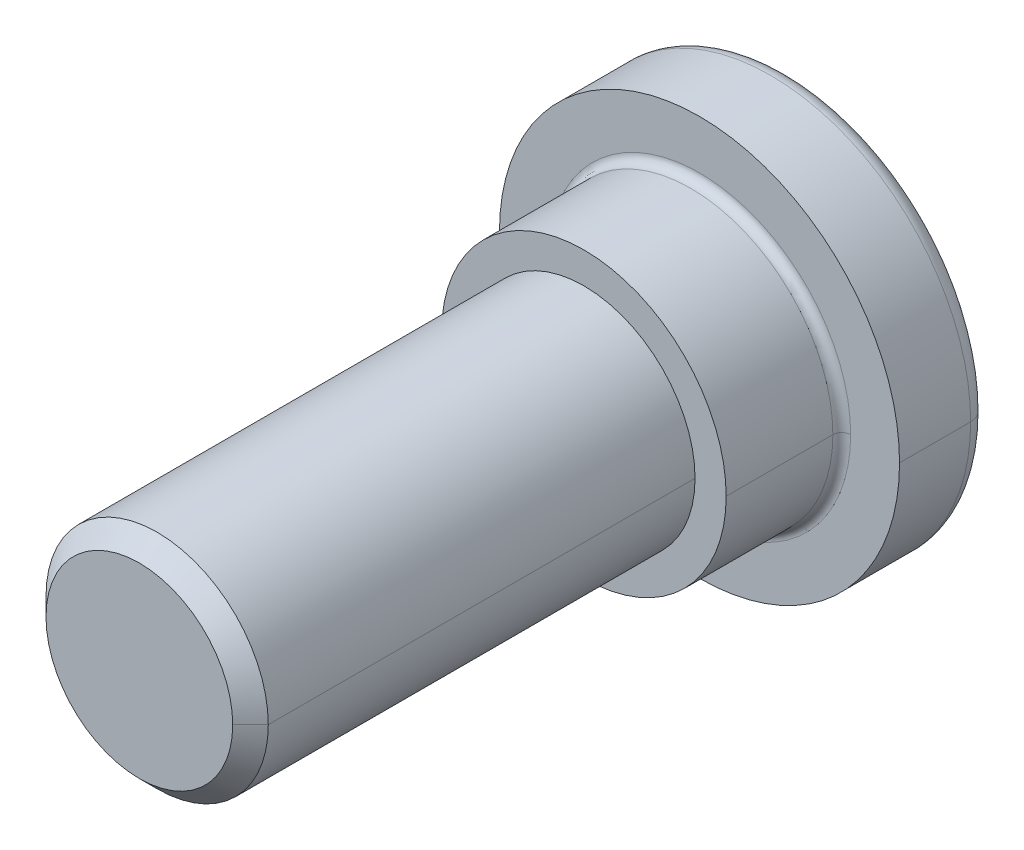
ISO-10303-21;
HEADER;
FILE_DESCRIPTION(('STEP AP214'),'2;1');
FILE_NAME('part.step','',(''),(''),'','','');
FILE_SCHEMA(('AUTOMOTIVE_DESIGN { 1 0 10303 214 1 1 1 1 }'));
ENDSEC;
DATA;
#1=APPLICATION_CONTEXT('core data for automotive mechanical design processes');
#2=APPLICATION_PROTOCOL_DEFINITION('international standard','automotive_design',2000,#1);
#3=PRODUCT_CONTEXT('',#1,'mechanical');
#4=PRODUCT('Part','Part','',(#3));
#5=PRODUCT_RELATED_PRODUCT_CATEGORY('part','',(#4));
#6=PRODUCT_DEFINITION_FORMATION('','',#4);
#7=PRODUCT_DEFINITION_CONTEXT('part definition',#1,'design');
#8=PRODUCT_DEFINITION('design','',#6,#7);
#9=PRODUCT_DEFINITION_SHAPE('','',#8);
#10=(LENGTH_UNIT() NAMED_UNIT(*) SI_UNIT(.MILLI.,.METRE.));
#11=(NAMED_UNIT(*) PLANE_ANGLE_UNIT() SI_UNIT($,.RADIAN.));
#12=(NAMED_UNIT(*) SI_UNIT($,.STERADIAN.) SOLID_ANGLE_UNIT());
#13=UNCERTAINTY_MEASURE_WITH_UNIT(LENGTH_MEASURE(1.E-05),#10,'distance_accuracy_value','');
#14=(GEOMETRIC_REPRESENTATION_CONTEXT(3) GLOBAL_UNCERTAINTY_ASSIGNED_CONTEXT((#13)) GLOBAL_UNIT_ASSIGNED_CONTEXT((#10,
#11,#12)) REPRESENTATION_CONTEXT('',''));
#15=CARTESIAN_POINT('',(0.,0.,0.));
#16=DIRECTION('',(0.,0.,1.));
#17=DIRECTION('',(1.,0.,0.));
#18=AXIS2_PLACEMENT_3D('',#15,#16,#17);
#19=CARTESIAN_POINT('',(0.,0.,1.1));
#20=DIRECTION('',(0.,0.,-1.));
#21=DIRECTION('',(0.,-1.,0.));
#22=AXIS2_PLACEMENT_3D('',#19,#20,#21);
#23=PLANE('',#22);
#24=DIRECTION('',(0.866025403784429,-0.500000000000017,0.));
#25=VECTOR('',#24,1.);
#26=CARTESIAN_POINT('',(-1.,-0.5773502691895,1.1));
#27=LINE('',#26,#25);
#28=CARTESIAN_POINT('',(-1.,-0.5773502691895,1.1));
#29=VERTEX_POINT('',#28);
#30=CARTESIAN_POINT('',(1.088799896045E-13,-1.154700538379,1.1));
#31=VERTEX_POINT('',#30);
#32=EDGE_CURVE('E173',#29,#31,#27,.T.);
#33=ORIENTED_EDGE('',*,*,#32,.F.);
#34=DIRECTION('',(0.,1.,0.));
#35=VECTOR('',#34,1.);
#36=CARTESIAN_POINT('',(-1.,-0.5773502691895,1.1));
#37=LINE('',#36,#35);
#38=CARTESIAN_POINT('',(-1.,0.5773502691896,1.1));
#39=VERTEX_POINT('',#38);
#40=EDGE_CURVE('E11',#29,#39,#37,.T.);
#41=ORIENTED_EDGE('',*,*,#40,.T.);
#42=DIRECTION('',(-0.866025403784454,-0.499999999999973,0.));
#43=VECTOR('',#42,1.);
#44=CARTESIAN_POINT('',(-1.088799896045E-13,1.154700538379,1.1));
#45=LINE('',#44,#43);
#46=CARTESIAN_POINT('',(-1.088799896045E-13,1.154700538379,1.1));
#47=VERTEX_POINT('',#46);
#48=EDGE_CURVE('E203',#47,#39,#45,.T.);
#49=ORIENTED_EDGE('',*,*,#48,.F.);
#50=DIRECTION('',(-0.866025403784429,0.500000000000017,0.));
#51=VECTOR('',#50,1.);
#52=CARTESIAN_POINT('',(1.,0.5773502691895,1.1));
#53=LINE('',#52,#51);
#54=CARTESIAN_POINT('',(1.,0.5773502691895,1.1));
#55=VERTEX_POINT('',#54);
#56=EDGE_CURVE('E255',#55,#47,#53,.T.);
#57=ORIENTED_EDGE('',*,*,#56,.F.);
#58=DIRECTION('',(0.,-1.,0.));
#59=VECTOR('',#58,1.);
#60=CARTESIAN_POINT('',(1.,0.5773502691895,1.1));
#61=LINE('',#60,#59);
#62=CARTESIAN_POINT('',(1.,-0.5773502691896,1.1));
#63=VERTEX_POINT('',#62);
#64=EDGE_CURVE('E252',#55,#63,#61,.T.);
#65=ORIENTED_EDGE('',*,*,#64,.T.);
#66=DIRECTION('',(0.866025403784454,0.499999999999973,0.));
#67=VECTOR('',#66,1.);
#68=CARTESIAN_POINT('',(1.088799896045E-13,-1.154700538379,1.1));
#69=LINE('',#68,#67);
#70=EDGE_CURVE('E20',#31,#63,#69,.T.);
#71=ORIENTED_EDGE('',*,*,#70,.F.);
#72=EDGE_LOOP('',(#33,#41,#49,#57,#65,#71));
#73=FACE_BOUND('',#72,.T.);
#74=ADVANCED_FACE('F16',(#73),#23,.T.);
#75=CARTESIAN_POINT('',(-1.,-0.5773502691896,1.1));
#76=DIRECTION('',(-1.,0.,0.));
#77=DIRECTION('',(0.,0.,1.));
#78=AXIS2_PLACEMENT_3D('',#75,#76,#77);
#79=PLANE('',#78);
#80=DIRECTION('',(0.,0.,-1.));
#81=VECTOR('',#80,1.);
#82=CARTESIAN_POINT('',(-1.,0.5773502691896,1.1));
#83=LINE('',#82,#81);
#84=CARTESIAN_POINT('',(-1.,0.5773502691895,0.));
#85=VERTEX_POINT('',#84);
#86=EDGE_CURVE('E27',#39,#85,#83,.T.);
#87=ORIENTED_EDGE('',*,*,#86,.F.);
#88=ORIENTED_EDGE('',*,*,#40,.F.);
#89=DIRECTION('',(0.,0.,-1.));
#90=VECTOR('',#89,1.);
#91=CARTESIAN_POINT('',(-1.,-0.5773502691895,1.1));
#92=LINE('',#91,#90);
#93=CARTESIAN_POINT('',(-1.,-0.5773502691895,0.));
#94=VERTEX_POINT('',#93);
#95=EDGE_CURVE('E163',#29,#94,#92,.T.);
#96=ORIENTED_EDGE('',*,*,#95,.T.);
#97=DIRECTION('',(0.,1.,0.));
#98=VECTOR('',#97,1.);
#99=CARTESIAN_POINT('',(-1.,-0.5773502691895,0.));
#100=LINE('',#99,#98);
#101=EDGE_CURVE('E164',#94,#85,#100,.T.);
#102=ORIENTED_EDGE('',*,*,#101,.T.);
#103=EDGE_LOOP('',(#87,#88,#96,#102));
#104=FACE_BOUND('',#103,.T.);
#105=ADVANCED_FACE('F408',(#104),#79,.F.);
#106=CARTESIAN_POINT('',(-1.,0.5773502691896,1.1));
#107=DIRECTION('',(-0.500000000000017,0.866025403784429,0.));
#108=DIRECTION('',(0.,0.,1.));
#109=AXIS2_PLACEMENT_3D('',#106,#107,#108);
#110=PLANE('',#109);
#111=DIRECTION('',(1.319558121804E-13,0.,-1.));
#112=VECTOR('',#111,1.);
#113=CARTESIAN_POINT('',(-1.088799896045E-13,1.154700538379,1.1));
#114=LINE('',#113,#112);
#115=CARTESIAN_POINT('',(0.,1.154700538379,0.));
#116=VERTEX_POINT('',#115);
#117=EDGE_CURVE('E206',#47,#116,#114,.T.);
#118=ORIENTED_EDGE('',*,*,#117,.F.);
#119=ORIENTED_EDGE('',*,*,#48,.T.);
#120=ORIENTED_EDGE('',*,*,#86,.T.);
#121=DIRECTION('',(0.866025403784454,0.499999999999973,0.));
#122=VECTOR('',#121,1.);
#123=CARTESIAN_POINT('',(-1.,0.5773502691895,0.));
#124=LINE('',#123,#122);
#125=EDGE_CURVE('E177',#85,#116,#124,.T.);
#126=ORIENTED_EDGE('',*,*,#125,.T.);
#127=EDGE_LOOP('',(#118,#119,#120,#126));
#128=FACE_BOUND('',#127,.T.);
#129=ADVANCED_FACE('F330',(#128),#110,.F.);
#130=CARTESIAN_POINT('',(0.,1.154700538379,1.1));
#131=DIRECTION('',(0.500000000000017,0.866025403784429,0.));
#132=DIRECTION('',(0.,0.,-1.));
#133=AXIS2_PLACEMENT_3D('',#130,#131,#132);
#134=PLANE('',#133);
#135=DIRECTION('',(0.,0.,-1.));
#136=VECTOR('',#135,1.);
#137=CARTESIAN_POINT('',(1.,0.5773502691895,1.1));
#138=LINE('',#137,#136);
#139=CARTESIAN_POINT('',(1.,0.5773502691895,0.));
#140=VERTEX_POINT('',#139);
#141=EDGE_CURVE('E190',#55,#140,#138,.T.);
#142=ORIENTED_EDGE('',*,*,#141,.F.);
#143=ORIENTED_EDGE('',*,*,#56,.T.);
#144=ORIENTED_EDGE('',*,*,#117,.T.);
#145=DIRECTION('',(0.866025403784429,-0.500000000000017,0.));
#146=VECTOR('',#145,1.);
#147=CARTESIAN_POINT('',(0.,1.154700538379,0.));
#148=LINE('',#147,#146);
#149=EDGE_CURVE('E186',#116,#140,#148,.T.);
#150=ORIENTED_EDGE('',*,*,#149,.T.);
#151=EDGE_LOOP('',(#142,#143,#144,#150));
#152=FACE_BOUND('',#151,.T.);
#153=ADVANCED_FACE('F324',(#152),#134,.F.);
#154=CARTESIAN_POINT('',(1.,0.5773502691896,1.1));
#155=DIRECTION('',(1.,0.,0.));
#156=DIRECTION('',(0.,1.,0.));
#157=AXIS2_PLACEMENT_3D('',#154,#155,#156);
#158=PLANE('',#157);
#159=DIRECTION('',(0.,0.,-1.));
#160=VECTOR('',#159,1.);
#161=CARTESIAN_POINT('',(1.,-0.5773502691896,1.1));
#162=LINE('',#161,#160);
#163=CARTESIAN_POINT('',(1.,-0.5773502691895,0.));
#164=VERTEX_POINT('',#163);
#165=EDGE_CURVE('E249',#63,#164,#162,.T.);
#166=ORIENTED_EDGE('',*,*,#165,.F.);
#167=ORIENTED_EDGE('',*,*,#64,.F.);
#168=ORIENTED_EDGE('',*,*,#141,.T.);
#169=DIRECTION('',(0.,-1.,0.));
#170=VECTOR('',#169,1.);
#171=CARTESIAN_POINT('',(1.,0.5773502691895,0.));
#172=LINE('',#171,#170);
#173=EDGE_CURVE('E248',#140,#164,#172,.T.);
#174=ORIENTED_EDGE('',*,*,#173,.T.);
#175=EDGE_LOOP('',(#166,#167,#168,#174));
#176=FACE_BOUND('',#175,.T.);
#177=ADVANCED_FACE('F421',(#176),#158,.F.);
#178=CARTESIAN_POINT('',(1.,-0.5773502691896,1.1));
#179=DIRECTION('',(0.500000000000017,-0.866025403784429,0.));
#180=DIRECTION('',(0.,0.,-1.));
#181=AXIS2_PLACEMENT_3D('',#178,#179,#180);
#182=PLANE('',#181);
#183=DIRECTION('',(-1.319558121804E-13,0.,-1.));
#184=VECTOR('',#183,1.);
#185=CARTESIAN_POINT('',(1.088799896045E-13,-1.154700538379,1.1));
#186=LINE('',#185,#184);
#187=CARTESIAN_POINT('',(0.,-1.154700538379,0.));
#188=VERTEX_POINT('',#187);
#189=EDGE_CURVE('E244',#31,#188,#186,.T.);
#190=ORIENTED_EDGE('',*,*,#189,.F.);
#191=ORIENTED_EDGE('',*,*,#70,.T.);
#192=ORIENTED_EDGE('',*,*,#165,.T.);
#193=DIRECTION('',(-0.866025403784454,-0.499999999999973,0.));
#194=VECTOR('',#193,1.);
#195=CARTESIAN_POINT('',(1.,-0.5773502691895,0.));
#196=LINE('',#195,#194);
#197=EDGE_CURVE('E272',#164,#188,#196,.T.);
#198=ORIENTED_EDGE('',*,*,#197,.T.);
#199=EDGE_LOOP('',(#190,#191,#192,#198));
#200=FACE_BOUND('',#199,.T.);
#201=ADVANCED_FACE('F418',(#200),#182,.F.);
#202=CARTESIAN_POINT('',(0.,-1.154700538379,1.1));
#203=DIRECTION('',(-0.500000000000017,-0.866025403784429,0.));
#204=DIRECTION('',(-0.866025403784429,0.500000000000017,0.));
#205=AXIS2_PLACEMENT_3D('',#202,#203,#204);
#206=PLANE('',#205);
#207=ORIENTED_EDGE('',*,*,#95,.F.);
#208=ORIENTED_EDGE('',*,*,#32,.T.);
#209=ORIENTED_EDGE('',*,*,#189,.T.);
#210=DIRECTION('',(-0.866025403784429,0.500000000000017,0.));
#211=VECTOR('',#210,1.);
#212=CARTESIAN_POINT('',(0.,-1.154700538379,0.));
#213=LINE('',#212,#211);
#214=EDGE_CURVE('E160',#188,#94,#213,.T.);
#215=ORIENTED_EDGE('',*,*,#214,.T.);
#216=EDGE_LOOP('',(#207,#208,#209,#215));
#217=FACE_BOUND('',#216,.T.);
#218=ADVANCED_FACE('F18',(#217),#206,.F.);
#219=CARTESIAN_POINT('',(0.,0.,0.2));
#220=DIRECTION('',(0.,0.,1.));
#221=DIRECTION('',(1.,0.,0.));
#222=AXIS2_PLACEMENT_3D('',#219,#220,#221);
#223=TOROIDAL_SURFACE('',#222,2.05,0.2);
#224=CARTESIAN_POINT('',(0.,0.,0.));
#225=DIRECTION('',(0.,0.,1.));
#226=DIRECTION('',(-1.,0.,0.));
#227=AXIS2_PLACEMENT_3D('',#224,#225,#226);
#228=CIRCLE('',#227,2.05);
#229=CARTESIAN_POINT('',(-2.05,0.,0.));
#230=VERTEX_POINT('',#229);
#231=CARTESIAN_POINT('',(2.05,0.,0.));
#232=VERTEX_POINT('',#231);
#233=EDGE_CURVE('E227',#230,#232,#228,.T.);
#234=ORIENTED_EDGE('',*,*,#233,.T.);
#235=CARTESIAN_POINT('',(2.05,0.,0.2));
#236=DIRECTION('',(0.,-1.,0.));
#237=DIRECTION('',(0.,0.,-1.));
#238=AXIS2_PLACEMENT_3D('',#235,#236,#237);
#239=CIRCLE('',#238,0.2);
#240=CARTESIAN_POINT('',(2.25,0.,0.2));
#241=VERTEX_POINT('',#240);
#242=EDGE_CURVE('E228',#232,#241,#239,.T.);
#243=ORIENTED_EDGE('',*,*,#242,.T.);
#244=CARTESIAN_POINT('',(0.,0.,0.2));
#245=DIRECTION('',(0.,0.,1.));
#246=DIRECTION('',(-1.,0.,0.));
#247=AXIS2_PLACEMENT_3D('',#244,#245,#246);
#248=CIRCLE('',#247,2.25);
#249=CARTESIAN_POINT('',(-2.25,0.,0.2));
#250=VERTEX_POINT('',#249);
#251=EDGE_CURVE('E195',#250,#241,#248,.T.);
#252=ORIENTED_EDGE('',*,*,#251,.F.);
#253=CARTESIAN_POINT('',(-2.05,0.,0.2));
#254=DIRECTION('',(0.,1.,0.));
#255=DIRECTION('',(0.,0.,-1.));
#256=AXIS2_PLACEMENT_3D('',#253,#254,#255);
#257=CIRCLE('',#256,0.2);
#258=EDGE_CURVE('E233',#230,#250,#257,.T.);
#259=ORIENTED_EDGE('',*,*,#258,.F.);
#260=EDGE_LOOP('',(#234,#243,#252,#259));
#261=FACE_BOUND('',#260,.T.);
#262=ADVANCED_FACE('F392',(#261),#223,.T.);
#263=CARTESIAN_POINT('',(0.,0.,0.));
#264=DIRECTION('',(0.,0.,1.));
#265=DIRECTION('',(1.,0.,0.));
#266=AXIS2_PLACEMENT_3D('',#263,#264,#265);
#267=PLANE('',#266);
#268=ORIENTED_EDGE('',*,*,#197,.F.);
#269=ORIENTED_EDGE('',*,*,#173,.F.);
#270=ORIENTED_EDGE('',*,*,#149,.F.);
#271=ORIENTED_EDGE('',*,*,#125,.F.);
#272=ORIENTED_EDGE('',*,*,#101,.F.);
#273=ORIENTED_EDGE('',*,*,#214,.F.);
#274=EDGE_LOOP('',(#268,#269,#270,#271,#272,#273));
#275=FACE_BOUND('',#274,.T.);
#276=CARTESIAN_POINT('',(0.,0.,0.));
#277=DIRECTION('',(0.,0.,1.));
#278=DIRECTION('',(1.,0.,0.));
#279=AXIS2_PLACEMENT_3D('',#276,#277,#278);
#280=CIRCLE('',#279,2.05);
#281=EDGE_CURVE('E223',#232,#230,#280,.T.);
#282=ORIENTED_EDGE('',*,*,#281,.F.);
#283=ORIENTED_EDGE('',*,*,#233,.F.);
#284=EDGE_LOOP('',(#282,#283));
#285=FACE_BOUND('',#284,.T.);
#286=ADVANCED_FACE('F332',(#275,#285),#267,.F.);
#287=CARTESIAN_POINT('',(0.,0.,0.2));
#288=DIRECTION('',(0.,0.,1.));
#289=DIRECTION('',(1.,0.,0.));
#290=AXIS2_PLACEMENT_3D('',#287,#288,#289);
#291=TOROIDAL_SURFACE('',#290,2.05,0.2);
#292=ORIENTED_EDGE('',*,*,#258,.T.);
#293=CARTESIAN_POINT('',(0.,0.,0.2));
#294=DIRECTION('',(0.,0.,1.));
#295=DIRECTION('',(1.,0.,0.));
#296=AXIS2_PLACEMENT_3D('',#293,#294,#295);
#297=CIRCLE('',#296,2.25);
#298=EDGE_CURVE('E229',#241,#250,#297,.T.);
#299=ORIENTED_EDGE('',*,*,#298,.F.);
#300=ORIENTED_EDGE('',*,*,#242,.F.);
#301=ORIENTED_EDGE('',*,*,#281,.T.);
#302=EDGE_LOOP('',(#292,#299,#300,#301));
#303=FACE_BOUND('',#302,.T.);
#304=ADVANCED_FACE('F396',(#303),#291,.T.);
#305=CARTESIAN_POINT('',(0.,0.,1.));
#306=DIRECTION('',(0.,0.,-1.));
#307=DIRECTION('',(-1.,0.,0.));
#308=AXIS2_PLACEMENT_3D('',#305,#306,#307);
#309=CYLINDRICAL_SURFACE('',#308,2.25);
#310=DIRECTION('',(0.,0.,-1.));
#311=VECTOR('',#310,1.);
#312=CARTESIAN_POINT('',(2.25,0.,1.));
#313=LINE('',#312,#311);
#314=CARTESIAN_POINT('',(2.25,0.,1.));
#315=VERTEX_POINT('',#314);
#316=EDGE_CURVE('E234',#315,#241,#313,.T.);
#317=ORIENTED_EDGE('',*,*,#316,.T.);
#318=ORIENTED_EDGE('',*,*,#298,.T.);
#319=DIRECTION('',(0.,0.,-1.));
#320=VECTOR('',#319,1.);
#321=CARTESIAN_POINT('',(-2.25,0.,1.));
#322=LINE('',#321,#320);
#323=CARTESIAN_POINT('',(-2.25,0.,1.));
#324=VERTEX_POINT('',#323);
#325=EDGE_CURVE('E192',#324,#250,#322,.T.);
#326=ORIENTED_EDGE('',*,*,#325,.F.);
#327=CARTESIAN_POINT('',(0.,0.,1.));
#328=DIRECTION('',(0.,0.,-1.));
#329=DIRECTION('',(-1.,0.,0.));
#330=AXIS2_PLACEMENT_3D('',#327,#328,#329);
#331=CIRCLE('',#330,2.25);
#332=EDGE_CURVE('E158',#324,#315,#331,.T.);
#333=ORIENTED_EDGE('',*,*,#332,.T.);
#334=EDGE_LOOP('',(#317,#318,#326,#333));
#335=FACE_BOUND('',#334,.T.);
#336=ADVANCED_FACE('F386',(#335),#309,.T.);
#337=CARTESIAN_POINT('',(0.,0.,1.));
#338=DIRECTION('',(0.,0.,-1.));
#339=DIRECTION('',(-1.,0.,0.));
#340=AXIS2_PLACEMENT_3D('',#337,#338,#339);
#341=CYLINDRICAL_SURFACE('',#340,2.25);
#342=CARTESIAN_POINT('',(0.,0.,1.));
#343=DIRECTION('',(0.,0.,-1.));
#344=DIRECTION('',(1.,0.,0.));
#345=AXIS2_PLACEMENT_3D('',#342,#343,#344);
#346=CIRCLE('',#345,2.25);
#347=EDGE_CURVE('E196',#315,#324,#346,.T.);
#348=ORIENTED_EDGE('',*,*,#347,.T.);
#349=ORIENTED_EDGE('',*,*,#325,.T.);
#350=ORIENTED_EDGE('',*,*,#251,.T.);
#351=ORIENTED_EDGE('',*,*,#316,.F.);
#352=EDGE_LOOP('',(#348,#349,#350,#351));
#353=FACE_BOUND('',#352,.T.);
#354=ADVANCED_FACE('F380',(#353),#341,.T.);
#355=CARTESIAN_POINT('',(0.,0.,1.));
#356=DIRECTION('',(0.,0.,1.));
#357=DIRECTION('',(1.,0.,0.));
#358=AXIS2_PLACEMENT_3D('',#355,#356,#357);
#359=PLANE('',#358);
#360=CARTESIAN_POINT('',(0.,0.,1.));
#361=DIRECTION('',(0.,0.,1.));
#362=DIRECTION('',(1.,0.,0.));
#363=AXIS2_PLACEMENT_3D('',#360,#361,#362);
#364=CIRCLE('',#363,1.7);
#365=CARTESIAN_POINT('',(1.7,0.,1.));
#366=VERTEX_POINT('',#365);
#367=CARTESIAN_POINT('',(-1.7,0.,1.));
#368=VERTEX_POINT('',#367);
#369=EDGE_CURVE('E288',#366,#368,#364,.T.);
#370=ORIENTED_EDGE('',*,*,#369,.F.);
#371=CARTESIAN_POINT('',(0.,0.,1.));
#372=DIRECTION('',(0.,0.,1.));
#373=DIRECTION('',(-1.,0.,0.));
#374=AXIS2_PLACEMENT_3D('',#371,#372,#373);
#375=CIRCLE('',#374,1.7);
#376=EDGE_CURVE('E157',#368,#366,#375,.T.);
#377=ORIENTED_EDGE('',*,*,#376,.F.);
#378=EDGE_LOOP('',(#370,#377));
#379=FACE_BOUND('',#378,.T.);
#380=ORIENTED_EDGE('',*,*,#332,.F.);
#381=ORIENTED_EDGE('',*,*,#347,.F.);
#382=EDGE_LOOP('',(#380,#381));
#383=FACE_BOUND('',#382,.T.);
#384=ADVANCED_FACE('F377',(#379,#383),#359,.T.);
#385=CARTESIAN_POINT('',(0.,0.,1.1));
#386=DIRECTION('',(0.,0.,1.));
#387=DIRECTION('',(1.,0.,0.));
#388=AXIS2_PLACEMENT_3D('',#385,#386,#387);
#389=TOROIDAL_SURFACE('',#388,1.7,0.1);
#390=CARTESIAN_POINT('',(-1.7,0.,1.1));
#391=DIRECTION('',(0.,1.,0.));
#392=DIRECTION('',(1.,0.,0.));
#393=AXIS2_PLACEMENT_3D('',#390,#391,#392);
#394=CIRCLE('',#393,0.1);
#395=CARTESIAN_POINT('',(-1.6,0.,1.1));
#396=VERTEX_POINT('',#395);
#397=EDGE_CURVE('E159',#396,#368,#394,.T.);
#398=ORIENTED_EDGE('',*,*,#397,.T.);
#399=ORIENTED_EDGE('',*,*,#376,.T.);
#400=CARTESIAN_POINT('',(1.7,0.,1.1));
#401=DIRECTION('',(0.,-1.,0.));
#402=DIRECTION('',(-1.,0.,0.));
#403=AXIS2_PLACEMENT_3D('',#400,#401,#402);
#404=CIRCLE('',#403,0.1);
#405=CARTESIAN_POINT('',(1.6,0.,1.1));
#406=VERTEX_POINT('',#405);
#407=EDGE_CURVE('E237',#406,#366,#404,.T.);
#408=ORIENTED_EDGE('',*,*,#407,.F.);
#409=CARTESIAN_POINT('',(0.,0.,1.1));
#410=DIRECTION('',(0.,0.,1.));
#411=DIRECTION('',(-1.,0.,0.));
#412=AXIS2_PLACEMENT_3D('',#409,#410,#411);
#413=CIRCLE('',#412,1.6);
#414=EDGE_CURVE('E131',#396,#406,#413,.T.);
#415=ORIENTED_EDGE('',*,*,#414,.F.);
#416=EDGE_LOOP('',(#398,#399,#408,#415));
#417=FACE_BOUND('',#416,.T.);
#418=ADVANCED_FACE('F372',(#417),#389,.F.);
#419=CARTESIAN_POINT('',(0.,0.,1.1));
#420=DIRECTION('',(0.,0.,1.));
#421=DIRECTION('',(1.,0.,0.));
#422=AXIS2_PLACEMENT_3D('',#419,#420,#421);
#423=TOROIDAL_SURFACE('',#422,1.7,0.1);
#424=CARTESIAN_POINT('',(0.,0.,1.1));
#425=DIRECTION('',(0.,0.,1.));
#426=DIRECTION('',(1.,0.,0.));
#427=AXIS2_PLACEMENT_3D('',#424,#425,#426);
#428=CIRCLE('',#427,1.6);
#429=EDGE_CURVE('E136',#406,#396,#428,.T.);
#430=ORIENTED_EDGE('',*,*,#429,.F.);
#431=ORIENTED_EDGE('',*,*,#407,.T.);
#432=ORIENTED_EDGE('',*,*,#369,.T.);
#433=ORIENTED_EDGE('',*,*,#397,.F.);
#434=EDGE_LOOP('',(#430,#431,#432,#433));
#435=FACE_BOUND('',#434,.T.);
#436=ADVANCED_FACE('F375',(#435),#423,.F.);
#437=CARTESIAN_POINT('',(0.,0.,2.3));
#438=DIRECTION('',(0.,0.,-1.));
#439=DIRECTION('',(-1.,0.,0.));
#440=AXIS2_PLACEMENT_3D('',#437,#438,#439);
#441=CYLINDRICAL_SURFACE('',#440,1.6);
#442=DIRECTION('',(0.,0.,-1.));
#443=VECTOR('',#442,1.);
#444=CARTESIAN_POINT('',(1.6,0.,2.3));
#445=LINE('',#444,#443);
#446=CARTESIAN_POINT('',(1.6,0.,2.3));
#447=VERTEX_POINT('',#446);
#448=EDGE_CURVE('E124',#447,#406,#445,.T.);
#449=ORIENTED_EDGE('',*,*,#448,.T.);
#450=ORIENTED_EDGE('',*,*,#429,.T.);
#451=DIRECTION('',(0.,0.,-1.));
#452=VECTOR('',#451,1.);
#453=CARTESIAN_POINT('',(-1.6,0.,2.3));
#454=LINE('',#453,#452);
#455=CARTESIAN_POINT('',(-1.6,0.,2.3));
#456=VERTEX_POINT('',#455);
#457=EDGE_CURVE('E142',#456,#396,#454,.T.);
#458=ORIENTED_EDGE('',*,*,#457,.F.);
#459=CARTESIAN_POINT('',(0.,0.,2.3));
#460=DIRECTION('',(0.,0.,-1.));
#461=DIRECTION('',(-1.,0.,0.));
#462=AXIS2_PLACEMENT_3D('',#459,#460,#461);
#463=CIRCLE('',#462,1.6);
#464=EDGE_CURVE('E140',#456,#447,#463,.T.);
#465=ORIENTED_EDGE('',*,*,#464,.T.);
#466=EDGE_LOOP('',(#449,#450,#458,#465));
#467=FACE_BOUND('',#466,.T.);
#468=ADVANCED_FACE('F144',(#467),#441,.T.);
#469=CARTESIAN_POINT('',(0.,0.,2.3));
#470=DIRECTION('',(0.,0.,-1.));
#471=DIRECTION('',(-1.,0.,0.));
#472=AXIS2_PLACEMENT_3D('',#469,#470,#471);
#473=CYLINDRICAL_SURFACE('',#472,1.6);
#474=CARTESIAN_POINT('',(0.,0.,2.3));
#475=DIRECTION('',(0.,0.,-1.));
#476=DIRECTION('',(1.,0.,0.));
#477=AXIS2_PLACEMENT_3D('',#474,#475,#476);
#478=CIRCLE('',#477,1.6);
#479=EDGE_CURVE('E128',#447,#456,#478,.T.);
#480=ORIENTED_EDGE('',*,*,#479,.T.);
#481=ORIENTED_EDGE('',*,*,#457,.T.);
#482=ORIENTED_EDGE('',*,*,#414,.T.);
#483=ORIENTED_EDGE('',*,*,#448,.F.);
#484=EDGE_LOOP('',(#480,#481,#482,#483));
#485=FACE_BOUND('',#484,.T.);
#486=ADVANCED_FACE('F126',(#485),#473,.T.);
#487=CARTESIAN_POINT('',(0.,0.,2.3));
#488=DIRECTION('',(0.,0.,1.));
#489=DIRECTION('',(1.,0.,0.));
#490=AXIS2_PLACEMENT_3D('',#487,#488,#489);
#491=PLANE('',#490);
#492=CARTESIAN_POINT('',(0.,0.,2.3));
#493=DIRECTION('',(0.,0.,1.));
#494=DIRECTION('',(1.,0.,0.));
#495=AXIS2_PLACEMENT_3D('',#492,#493,#494);
#496=CIRCLE('',#495,1.25);
#497=CARTESIAN_POINT('',(1.25,0.,2.3));
#498=VERTEX_POINT('',#497);
#499=CARTESIAN_POINT('',(-1.25,0.,2.3));
#500=VERTEX_POINT('',#499);
#501=EDGE_CURVE('E201',#498,#500,#496,.T.);
#502=ORIENTED_EDGE('',*,*,#501,.F.);
#503=CARTESIAN_POINT('',(0.,0.,2.3));
#504=DIRECTION('',(0.,0.,1.));
#505=DIRECTION('',(-1.,0.,0.));
#506=AXIS2_PLACEMENT_3D('',#503,#504,#505);
#507=CIRCLE('',#506,1.25);
#508=EDGE_CURVE('E146',#500,#498,#507,.T.);
#509=ORIENTED_EDGE('',*,*,#508,.F.);
#510=EDGE_LOOP('',(#502,#509));
#511=FACE_BOUND('',#510,.T.);
#512=ORIENTED_EDGE('',*,*,#464,.F.);
#513=ORIENTED_EDGE('',*,*,#479,.F.);
#514=EDGE_LOOP('',(#512,#513));
#515=FACE_BOUND('',#514,.T.);
#516=ADVANCED_FACE('F139',(#511,#515),#491,.T.);
#517=CARTESIAN_POINT('',(0.,0.,7.3));
#518=DIRECTION('',(0.,0.,-1.));
#519=DIRECTION('',(-1.,0.,0.));
#520=AXIS2_PLACEMENT_3D('',#517,#518,#519);
#521=CYLINDRICAL_SURFACE('',#520,1.25);
#522=CARTESIAN_POINT('',(0.,0.,7.1));
#523=DIRECTION('',(0.,0.,-1.));
#524=DIRECTION('',(1.,0.,0.));
#525=AXIS2_PLACEMENT_3D('',#522,#523,#524);
#526=CIRCLE('',#525,1.25);
#527=CARTESIAN_POINT('',(1.25,0.,7.1));
#528=VERTEX_POINT('',#527);
#529=CARTESIAN_POINT('',(-1.25,0.,7.1));
#530=VERTEX_POINT('',#529);
#531=EDGE_CURVE('E156',#528,#530,#526,.T.);
#532=ORIENTED_EDGE('',*,*,#531,.T.);
#533=DIRECTION('',(0.,0.,-1.));
#534=VECTOR('',#533,1.);
#535=CARTESIAN_POINT('',(-1.25,0.,7.1));
#536=LINE('',#535,#534);
#537=EDGE_CURVE('E152',#530,#500,#536,.T.);
#538=ORIENTED_EDGE('',*,*,#537,.T.);
#539=ORIENTED_EDGE('',*,*,#508,.T.);
#540=DIRECTION('',(0.,0.,-1.));
#541=VECTOR('',#540,1.);
#542=CARTESIAN_POINT('',(1.25,0.,7.1));
#543=LINE('',#542,#541);
#544=EDGE_CURVE('E197',#528,#498,#543,.T.);
#545=ORIENTED_EDGE('',*,*,#544,.F.);
#546=EDGE_LOOP('',(#532,#538,#539,#545));
#547=FACE_BOUND('',#546,.T.);
#548=ADVANCED_FACE('F354',(#547),#521,.T.);
#549=CARTESIAN_POINT('',(0.,0.,7.3));
#550=DIRECTION('',(0.,0.,-1.));
#551=DIRECTION('',(-1.,0.,0.));
#552=AXIS2_PLACEMENT_3D('',#549,#550,#551);
#553=CYLINDRICAL_SURFACE('',#552,1.25);
#554=ORIENTED_EDGE('',*,*,#544,.T.);
#555=ORIENTED_EDGE('',*,*,#501,.T.);
#556=ORIENTED_EDGE('',*,*,#537,.F.);
#557=CARTESIAN_POINT('',(0.,0.,7.1));
#558=DIRECTION('',(0.,0.,-1.));
#559=DIRECTION('',(-1.,0.,0.));
#560=AXIS2_PLACEMENT_3D('',#557,#558,#559);
#561=CIRCLE('',#560,1.25);
#562=EDGE_CURVE('E202',#530,#528,#561,.T.);
#563=ORIENTED_EDGE('',*,*,#562,.T.);
#564=EDGE_LOOP('',(#554,#555,#556,#563));
#565=FACE_BOUND('',#564,.T.);
#566=ADVANCED_FACE('F358',(#565),#553,.T.);
#567=CARTESIAN_POINT('',(0.,0.,7.2));
#568=DIRECTION('',(0.,0.,-1.));
#569=DIRECTION('',(-1.,0.,0.));
#570=AXIS2_PLACEMENT_3D('',#567,#568,#569);
#571=CONICAL_SURFACE('',#570,1.15,0.7853981633973);
#572=DIRECTION('',(0.707106781186598,0.,-0.707106781186498));
#573=VECTOR('',#572,1.);
#574=CARTESIAN_POINT('',(1.05,0.,7.3));
#575=LINE('',#574,#573);
#576=CARTESIAN_POINT('',(1.05,0.,7.3));
#577=VERTEX_POINT('',#576);
#578=EDGE_CURVE('E219',#577,#528,#575,.T.);
#579=ORIENTED_EDGE('',*,*,#578,.T.);
#580=ORIENTED_EDGE('',*,*,#562,.F.);
#581=DIRECTION('',(-0.707106781186598,0.,-0.707106781186498));
#582=VECTOR('',#581,1.);
#583=CARTESIAN_POINT('',(-1.05,0.,7.3));
#584=LINE('',#583,#582);
#585=CARTESIAN_POINT('',(-1.05,0.,7.3));
#586=VERTEX_POINT('',#585);
#587=EDGE_CURVE('E211',#586,#530,#584,.T.);
#588=ORIENTED_EDGE('',*,*,#587,.F.);
#589=CARTESIAN_POINT('',(0.,0.,7.3));
#590=DIRECTION('',(0.,0.,-1.));
#591=DIRECTION('',(-1.,0.,0.));
#592=AXIS2_PLACEMENT_3D('',#589,#590,#591);
#593=CIRCLE('',#592,1.05);
#594=EDGE_CURVE('E266',#586,#577,#593,.T.);
#595=ORIENTED_EDGE('',*,*,#594,.T.);
#596=EDGE_LOOP('',(#579,#580,#588,#595));
#597=FACE_BOUND('',#596,.T.);
#598=ADVANCED_FACE('F422',(#597),#571,.T.);
#599=CARTESIAN_POINT('',(0.,0.,7.2));
#600=DIRECTION('',(0.,0.,-1.));
#601=DIRECTION('',(-1.,0.,0.));
#602=AXIS2_PLACEMENT_3D('',#599,#600,#601);
#603=CONICAL_SURFACE('',#602,1.15,0.7853981633973);
#604=CARTESIAN_POINT('',(0.,0.,7.3));
#605=DIRECTION('',(0.,0.,-1.));
#606=DIRECTION('',(1.,0.,0.));
#607=AXIS2_PLACEMENT_3D('',#604,#605,#606);
#608=CIRCLE('',#607,1.05);
#609=EDGE_CURVE('E215',#577,#586,#608,.T.);
#610=ORIENTED_EDGE('',*,*,#609,.T.);
#611=ORIENTED_EDGE('',*,*,#587,.T.);
#612=ORIENTED_EDGE('',*,*,#531,.F.);
#613=ORIENTED_EDGE('',*,*,#578,.F.);
#614=EDGE_LOOP('',(#610,#611,#612,#613));
#615=FACE_BOUND('',#614,.T.);
#616=ADVANCED_FACE('F425',(#615),#603,.T.);
#617=CARTESIAN_POINT('',(0.,0.,7.3));
#618=DIRECTION('',(0.,0.,1.));
#619=DIRECTION('',(1.,0.,0.));
#620=AXIS2_PLACEMENT_3D('',#617,#618,#619);
#621=PLANE('',#620);
#622=ORIENTED_EDGE('',*,*,#594,.F.);
#623=ORIENTED_EDGE('',*,*,#609,.F.);
#624=EDGE_LOOP('',(#622,#623));
#625=FACE_BOUND('',#624,.T.);
#626=ADVANCED_FACE('F445',(#625),#621,.T.);
#627=CLOSED_SHELL('',(#74,#105,#129,#153,#177,#201,#218,#262,#286,#304,#336,#354,#384,#418,#436,
#468,#486,#516,#548,#566,#598,#616,#626));
#628=MANIFOLD_SOLID_BREP('B1',#627);
#629=ADVANCED_BREP_SHAPE_REPRESENTATION('',(#18,#628),#14);
#630=SHAPE_DEFINITION_REPRESENTATION(#9,#629);
ENDSEC;
END-ISO-10303-21;
